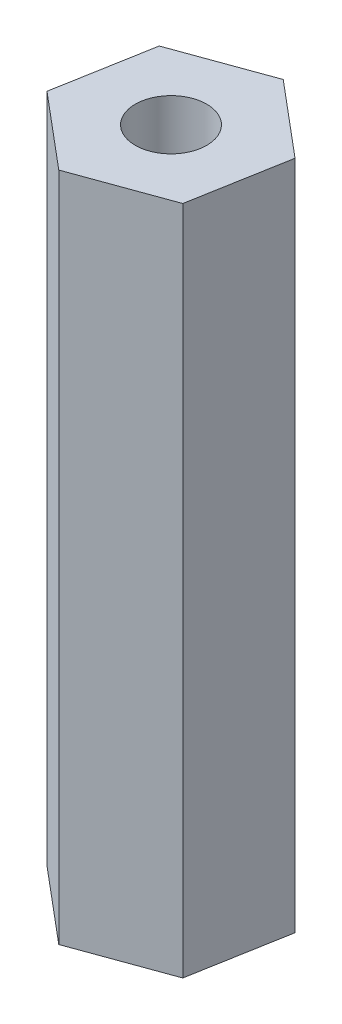
ISO-10303-21;
HEADER;
FILE_DESCRIPTION(('STEP AP214'),'2;1');
FILE_NAME('part.step','',(''),(''),'','','');
FILE_SCHEMA(('AUTOMOTIVE_DESIGN { 1 0 10303 214 1 1 1 1 }'));
ENDSEC;
DATA;
#1=APPLICATION_CONTEXT('core data for automotive mechanical design processes');
#2=APPLICATION_PROTOCOL_DEFINITION('international standard','automotive_design',2000,#1);
#3=PRODUCT_CONTEXT('',#1,'mechanical');
#4=PRODUCT('Part','Part','',(#3));
#5=PRODUCT_RELATED_PRODUCT_CATEGORY('part','',(#4));
#6=PRODUCT_DEFINITION_FORMATION('','',#4);
#7=PRODUCT_DEFINITION_CONTEXT('part definition',#1,'design');
#8=PRODUCT_DEFINITION('design','',#6,#7);
#9=PRODUCT_DEFINITION_SHAPE('','',#8);
#10=(LENGTH_UNIT() NAMED_UNIT(*) SI_UNIT(.MILLI.,.METRE.));
#11=(NAMED_UNIT(*) PLANE_ANGLE_UNIT() SI_UNIT($,.RADIAN.));
#12=(NAMED_UNIT(*) SI_UNIT($,.STERADIAN.) SOLID_ANGLE_UNIT());
#13=UNCERTAINTY_MEASURE_WITH_UNIT(LENGTH_MEASURE(1.E-05),#10,'distance_accuracy_value','');
#14=(GEOMETRIC_REPRESENTATION_CONTEXT(3) GLOBAL_UNCERTAINTY_ASSIGNED_CONTEXT((#13)) GLOBAL_UNIT_ASSIGNED_CONTEXT((#10,
#11,#12)) REPRESENTATION_CONTEXT('',''));
#15=CARTESIAN_POINT('',(0.,0.,0.));
#16=DIRECTION('',(0.,0.,1.));
#17=DIRECTION('',(1.,0.,0.));
#18=AXIS2_PLACEMENT_3D('',#15,#16,#17);
#19=CARTESIAN_POINT('',(0.640454426321229,25.4,-3.60979936577351));
#20=DIRECTION('',(0.341023041550075,0.,0.94005493729459));
#21=DIRECTION('',(0.94005493729459,0.,-0.341023041550075));
#22=AXIS2_PLACEMENT_3D('',#19,#20,#21);
#23=PLANE('',#22);
#24=DIRECTION('',(-0.94005493729459,0.,0.341023041550075));
#25=VECTOR('',#24,1.);
#26=CARTESIAN_POINT('',(0.640454426321229,0.,-3.60979936577351));
#27=LINE('',#26,#25);
#28=CARTESIAN_POINT('',(0.640454426321229,0.,-3.60979936577351));
#29=VERTEX_POINT('',#28);
#30=CARTESIAN_POINT('',(-2.8059507401642,0.,-2.35954948604713));
#31=VERTEX_POINT('',#30);
#32=EDGE_CURVE('E117',#29,#31,#27,.T.);
#33=ORIENTED_EDGE('',*,*,#32,.T.);
#34=DIRECTION('',(0.,-1.,0.));
#35=VECTOR('',#34,1.);
#36=CARTESIAN_POINT('',(-2.8059507401642,25.4,-2.35954948604713));
#37=LINE('',#36,#35);
#38=CARTESIAN_POINT('',(-2.8059507401642,25.4,-2.35954948604713));
#39=VERTEX_POINT('',#38);
#40=EDGE_CURVE('E11',#39,#31,#37,.T.);
#41=ORIENTED_EDGE('',*,*,#40,.F.);
#42=DIRECTION('',(-0.94005493729459,0.,0.341023041550075));
#43=VECTOR('',#42,1.);
#44=CARTESIAN_POINT('',(0.640454426321229,25.4,-3.60979936577351));
#45=LINE('',#44,#43);
#46=CARTESIAN_POINT('',(0.640454426321229,25.4,-3.60979936577351));
#47=VERTEX_POINT('',#46);
#48=EDGE_CURVE('E128',#47,#39,#45,.T.);
#49=ORIENTED_EDGE('',*,*,#48,.F.);
#50=DIRECTION('',(0.,-1.,0.));
#51=VECTOR('',#50,1.);
#52=CARTESIAN_POINT('',(0.640454426321229,25.4,-3.60979936577351));
#53=LINE('',#52,#51);
#54=EDGE_CURVE('E113',#47,#29,#53,.T.);
#55=ORIENTED_EDGE('',*,*,#54,.T.);
#56=EDGE_LOOP('',(#33,#41,#49,#55));
#57=FACE_BOUND('',#56,.T.);
#58=ADVANCED_FACE('F33',(#57),#23,.F.);
#59=CARTESIAN_POINT('',(-2.8059507401642,25.4,-2.35954948604713));
#60=DIRECTION('',(0.98462297742514,0.,0.174692851389094));
#61=DIRECTION('',(0.174692851389094,0.,-0.98462297742514));
#62=AXIS2_PLACEMENT_3D('',#59,#60,#61);
#63=PLANE('',#62);
#64=DIRECTION('',(-0.174692851389094,0.,0.98462297742514));
#65=VECTOR('',#64,1.);
#66=CARTESIAN_POINT('',(-2.8059507401642,0.,-2.35954948604713));
#67=LINE('',#66,#65);
#68=CARTESIAN_POINT('',(-3.44640516648543,0.,1.25024987972638));
#69=VERTEX_POINT('',#68);
#70=EDGE_CURVE('E120',#31,#69,#67,.T.);
#71=ORIENTED_EDGE('',*,*,#70,.T.);
#72=DIRECTION('',(0.,-1.,0.));
#73=VECTOR('',#72,1.);
#74=CARTESIAN_POINT('',(-3.44640516648543,25.4,1.25024987972638));
#75=LINE('',#74,#73);
#76=CARTESIAN_POINT('',(-3.44640516648543,25.4,1.25024987972638));
#77=VERTEX_POINT('',#76);
#78=EDGE_CURVE('E41',#77,#69,#75,.T.);
#79=ORIENTED_EDGE('',*,*,#78,.F.);
#80=DIRECTION('',(-0.174692851389094,0.,0.98462297742514));
#81=VECTOR('',#80,1.);
#82=CARTESIAN_POINT('',(-2.8059507401642,25.4,-2.35954948604713));
#83=LINE('',#82,#81);
#84=EDGE_CURVE('E86',#39,#77,#83,.T.);
#85=ORIENTED_EDGE('',*,*,#84,.F.);
#86=ORIENTED_EDGE('',*,*,#40,.T.);
#87=EDGE_LOOP('',(#71,#79,#85,#86));
#88=FACE_BOUND('',#87,.T.);
#89=ADVANCED_FACE('F153',(#88),#63,.F.);
#90=CARTESIAN_POINT('',(-3.44640516648543,25.4,1.25024987972638));
#91=DIRECTION('',(0.643599935875065,0.,-0.765362085905496));
#92=DIRECTION('',(-0.765362085905496,0.,-0.643599935875065));
#93=AXIS2_PLACEMENT_3D('',#90,#91,#92);
#94=PLANE('',#93);
#95=DIRECTION('',(0.765362085905496,0.,0.643599935875065));
#96=VECTOR('',#95,1.);
#97=CARTESIAN_POINT('',(-3.44640516648543,0.,1.25024987972638));
#98=LINE('',#97,#96);
#99=CARTESIAN_POINT('',(-0.640454426321229,0.,3.60979936577351));
#100=VERTEX_POINT('',#99);
#101=EDGE_CURVE('E123',#69,#100,#98,.T.);
#102=ORIENTED_EDGE('',*,*,#101,.T.);
#103=DIRECTION('',(0.,-1.,0.));
#104=VECTOR('',#103,1.);
#105=CARTESIAN_POINT('',(-0.640454426321229,25.4,3.60979936577351));
#106=LINE('',#105,#104);
#107=CARTESIAN_POINT('',(-0.640454426321229,25.4,3.60979936577351));
#108=VERTEX_POINT('',#107);
#109=EDGE_CURVE('E108',#108,#100,#106,.T.);
#110=ORIENTED_EDGE('',*,*,#109,.F.);
#111=DIRECTION('',(0.765362085905496,0.,0.643599935875065));
#112=VECTOR('',#111,1.);
#113=CARTESIAN_POINT('',(-3.44640516648543,25.4,1.25024987972638));
#114=LINE('',#113,#112);
#115=EDGE_CURVE('E99',#77,#108,#114,.T.);
#116=ORIENTED_EDGE('',*,*,#115,.F.);
#117=ORIENTED_EDGE('',*,*,#78,.T.);
#118=EDGE_LOOP('',(#102,#110,#116,#117));
#119=FACE_BOUND('',#118,.T.);
#120=ADVANCED_FACE('F134',(#119),#94,.F.);
#121=CARTESIAN_POINT('',(-0.640454426321229,25.4,3.60979936577351));
#122=DIRECTION('',(-0.341023041550076,0.,-0.94005493729459));
#123=DIRECTION('',(-0.94005493729459,0.,0.341023041550076));
#124=AXIS2_PLACEMENT_3D('',#121,#122,#123);
#125=PLANE('',#124);
#126=DIRECTION('',(0.94005493729459,0.,-0.341023041550076));
#127=VECTOR('',#126,1.);
#128=CARTESIAN_POINT('',(-0.640454426321229,0.,3.60979936577351));
#129=LINE('',#128,#127);
#130=CARTESIAN_POINT('',(2.8059507401642,0.,2.35954948604712));
#131=VERTEX_POINT('',#130);
#132=EDGE_CURVE('E107',#100,#131,#129,.T.);
#133=ORIENTED_EDGE('',*,*,#132,.T.);
#134=DIRECTION('',(0.,-1.,0.));
#135=VECTOR('',#134,1.);
#136=CARTESIAN_POINT('',(2.8059507401642,25.4,2.35954948604712));
#137=LINE('',#136,#135);
#138=CARTESIAN_POINT('',(2.8059507401642,25.4,2.35954948604712));
#139=VERTEX_POINT('',#138);
#140=EDGE_CURVE('E104',#139,#131,#137,.T.);
#141=ORIENTED_EDGE('',*,*,#140,.F.);
#142=DIRECTION('',(0.94005493729459,0.,-0.341023041550076));
#143=VECTOR('',#142,1.);
#144=CARTESIAN_POINT('',(-0.640454426321229,25.4,3.60979936577351));
#145=LINE('',#144,#143);
#146=EDGE_CURVE('E93',#108,#139,#145,.T.);
#147=ORIENTED_EDGE('',*,*,#146,.F.);
#148=ORIENTED_EDGE('',*,*,#109,.T.);
#149=EDGE_LOOP('',(#133,#141,#147,#148));
#150=FACE_BOUND('',#149,.T.);
#151=ADVANCED_FACE('F105',(#150),#125,.F.);
#152=CARTESIAN_POINT('',(2.8059507401642,25.4,2.35954948604712));
#153=DIRECTION('',(-0.98462297742514,0.,-0.174692851389094));
#154=DIRECTION('',(-0.174692851389094,0.,0.98462297742514));
#155=AXIS2_PLACEMENT_3D('',#152,#153,#154);
#156=PLANE('',#155);
#157=DIRECTION('',(0.174692851389094,0.,-0.98462297742514));
#158=VECTOR('',#157,1.);
#159=CARTESIAN_POINT('',(2.8059507401642,0.,2.35954948604712));
#160=LINE('',#159,#158);
#161=CARTESIAN_POINT('',(3.44640516648543,0.,-1.25024987972639));
#162=VERTEX_POINT('',#161);
#163=EDGE_CURVE('E72',#131,#162,#160,.T.);
#164=ORIENTED_EDGE('',*,*,#163,.T.);
#165=DIRECTION('',(0.,-1.,0.));
#166=VECTOR('',#165,1.);
#167=CARTESIAN_POINT('',(3.44640516648543,25.4,-1.25024987972639));
#168=LINE('',#167,#166);
#169=CARTESIAN_POINT('',(3.44640516648543,25.4,-1.25024987972639));
#170=VERTEX_POINT('',#169);
#171=EDGE_CURVE('E109',#170,#162,#168,.T.);
#172=ORIENTED_EDGE('',*,*,#171,.F.);
#173=DIRECTION('',(0.174692851389094,0.,-0.98462297742514));
#174=VECTOR('',#173,1.);
#175=CARTESIAN_POINT('',(2.8059507401642,25.4,2.35954948604712));
#176=LINE('',#175,#174);
#177=EDGE_CURVE('E97',#139,#170,#176,.T.);
#178=ORIENTED_EDGE('',*,*,#177,.F.);
#179=ORIENTED_EDGE('',*,*,#140,.T.);
#180=EDGE_LOOP('',(#164,#172,#178,#179));
#181=FACE_BOUND('',#180,.T.);
#182=ADVANCED_FACE('F111',(#181),#156,.F.);
#183=CARTESIAN_POINT('',(3.44640516648543,25.4,-1.25024987972639));
#184=DIRECTION('',(-0.643599935875065,0.,0.765362085905496));
#185=DIRECTION('',(0.765362085905496,0.,0.643599935875065));
#186=AXIS2_PLACEMENT_3D('',#183,#184,#185);
#187=PLANE('',#186);
#188=DIRECTION('',(-0.765362085905496,0.,-0.643599935875065));
#189=VECTOR('',#188,1.);
#190=CARTESIAN_POINT('',(3.44640516648543,0.,-1.25024987972639));
#191=LINE('',#190,#189);
#192=EDGE_CURVE('E78',#162,#29,#191,.T.);
#193=ORIENTED_EDGE('',*,*,#192,.T.);
#194=ORIENTED_EDGE('',*,*,#54,.F.);
#195=DIRECTION('',(-0.765362085905496,0.,-0.643599935875065));
#196=VECTOR('',#195,1.);
#197=CARTESIAN_POINT('',(3.44640516648543,25.4,-1.25024987972639));
#198=LINE('',#197,#196);
#199=EDGE_CURVE('E49',#170,#47,#198,.T.);
#200=ORIENTED_EDGE('',*,*,#199,.F.);
#201=ORIENTED_EDGE('',*,*,#171,.T.);
#202=EDGE_LOOP('',(#193,#194,#200,#201));
#203=FACE_BOUND('',#202,.T.);
#204=ADVANCED_FACE('F141',(#203),#187,.F.);
#205=CARTESIAN_POINT('',(0.,25.4,0.));
#206=DIRECTION('',(0.,1.,0.));
#207=DIRECTION('',(0.,0.,1.));
#208=AXIS2_PLACEMENT_3D('',#205,#206,#207);
#209=PLANE('',#208);
#210=CARTESIAN_POINT('',(0.,25.4,0.));
#211=DIRECTION('',(0.,1.,0.));
#212=DIRECTION('',(0.,0.,1.));
#213=AXIS2_PLACEMENT_3D('',#210,#211,#212);
#214=CIRCLE('',#213,1.35255);
#215=CARTESIAN_POINT('',(0.,25.4,1.35255));
#216=VERTEX_POINT('',#215);
#217=EDGE_CURVE('E208',#216,#216,#214,.T.);
#218=ORIENTED_EDGE('',*,*,#217,.F.);
#219=EDGE_LOOP('',(#218));
#220=FACE_BOUND('',#219,.T.);
#221=ORIENTED_EDGE('',*,*,#48,.T.);
#222=ORIENTED_EDGE('',*,*,#84,.T.);
#223=ORIENTED_EDGE('',*,*,#115,.T.);
#224=ORIENTED_EDGE('',*,*,#146,.T.);
#225=ORIENTED_EDGE('',*,*,#177,.T.);
#226=ORIENTED_EDGE('',*,*,#199,.T.);
#227=EDGE_LOOP('',(#221,#222,#223,#224,#225,#226));
#228=FACE_BOUND('',#227,.T.);
#229=ADVANCED_FACE('F95',(#220,#228),#209,.T.);
#230=CARTESIAN_POINT('',(0.,0.,0.));
#231=DIRECTION('',(0.,1.,0.));
#232=DIRECTION('',(0.,0.,1.));
#233=AXIS2_PLACEMENT_3D('',#230,#231,#232);
#234=PLANE('',#233);
#235=CARTESIAN_POINT('',(0.,0.,0.));
#236=DIRECTION('',(0.,1.,0.));
#237=DIRECTION('',(0.,0.,1.));
#238=AXIS2_PLACEMENT_3D('',#235,#236,#237);
#239=CIRCLE('',#238,1.35255);
#240=CARTESIAN_POINT('',(0.,0.,1.35255));
#241=VERTEX_POINT('',#240);
#242=EDGE_CURVE('E121',#241,#241,#239,.T.);
#243=ORIENTED_EDGE('',*,*,#242,.T.);
#244=EDGE_LOOP('',(#243));
#245=FACE_BOUND('',#244,.T.);
#246=ORIENTED_EDGE('',*,*,#32,.F.);
#247=ORIENTED_EDGE('',*,*,#192,.F.);
#248=ORIENTED_EDGE('',*,*,#163,.F.);
#249=ORIENTED_EDGE('',*,*,#132,.F.);
#250=ORIENTED_EDGE('',*,*,#101,.F.);
#251=ORIENTED_EDGE('',*,*,#70,.F.);
#252=EDGE_LOOP('',(#246,#247,#248,#249,#250,#251));
#253=FACE_BOUND('',#252,.T.);
#254=ADVANCED_FACE('F137',(#245,#253),#234,.F.);
#255=CARTESIAN_POINT('',(0.,0.,0.));
#256=DIRECTION('',(0.,1.,0.));
#257=DIRECTION('',(0.,0.,1.));
#258=AXIS2_PLACEMENT_3D('',#255,#256,#257);
#259=CYLINDRICAL_SURFACE('',#258,1.35255);
#260=ORIENTED_EDGE('',*,*,#242,.F.);
#261=EDGE_LOOP('',(#260));
#262=FACE_BOUND('',#261,.T.);
#263=ORIENTED_EDGE('',*,*,#217,.T.);
#264=EDGE_LOOP('',(#263));
#265=FACE_BOUND('',#264,.T.);
#266=ADVANCED_FACE('F190',(#262,#265),#259,.F.);
#267=CLOSED_SHELL('',(#58,#89,#120,#151,#182,#204,#229,#254,#266));
#268=MANIFOLD_SOLID_BREP('B2',#267);
#269=ADVANCED_BREP_SHAPE_REPRESENTATION('',(#18,#268),#14);
#270=SHAPE_DEFINITION_REPRESENTATION(#9,#269);
ENDSEC;
END-ISO-10303-21;
